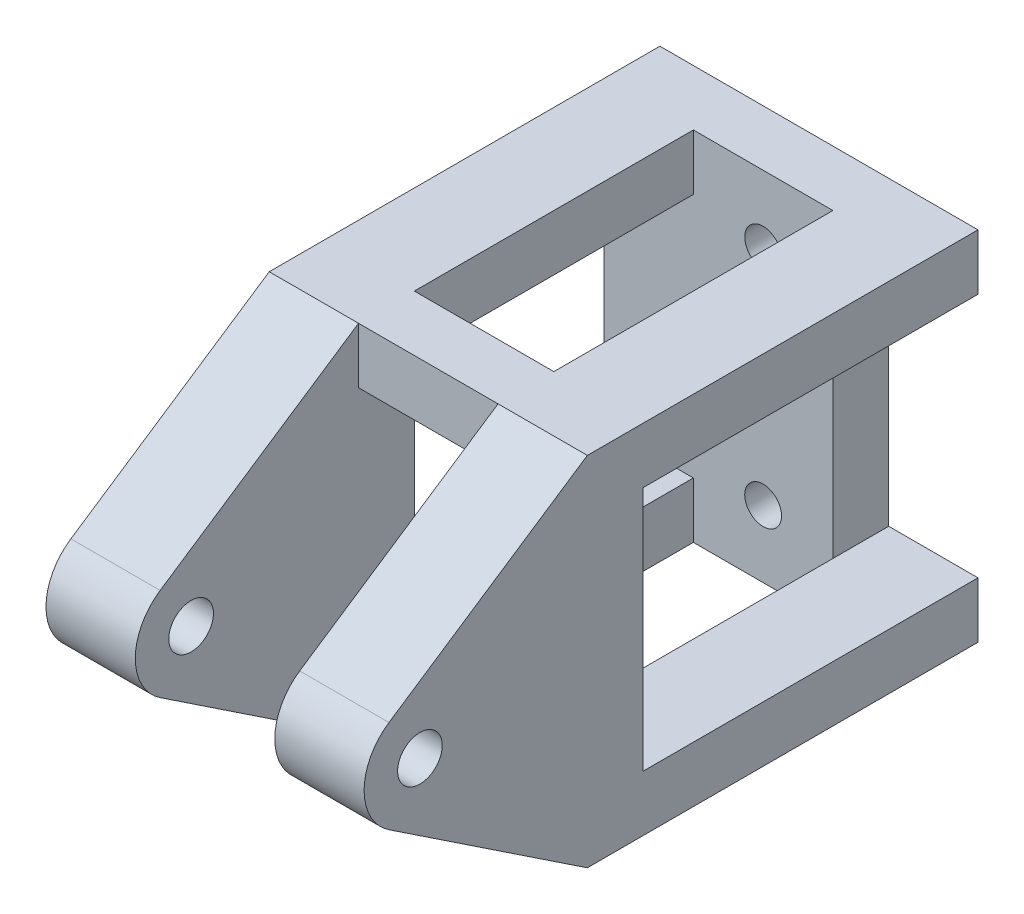
ISO-10303-21;
HEADER;
FILE_DESCRIPTION(('STEP AP214'),'2;1');
FILE_NAME('part.step','',(''),(''),'','','');
FILE_SCHEMA(('AUTOMOTIVE_DESIGN { 1 0 10303 214 1 1 1 1 }'));
ENDSEC;
DATA;
#1=APPLICATION_CONTEXT('core data for automotive mechanical design processes');
#2=APPLICATION_PROTOCOL_DEFINITION('international standard','automotive_design',2000,#1);
#3=PRODUCT_CONTEXT('',#1,'mechanical');
#4=PRODUCT('Part','Part','',(#3));
#5=PRODUCT_RELATED_PRODUCT_CATEGORY('part','',(#4));
#6=PRODUCT_DEFINITION_FORMATION('','',#4);
#7=PRODUCT_DEFINITION_CONTEXT('part definition',#1,'design');
#8=PRODUCT_DEFINITION('design','',#6,#7);
#9=PRODUCT_DEFINITION_SHAPE('','',#8);
#10=(LENGTH_UNIT() NAMED_UNIT(*) SI_UNIT(.MILLI.,.METRE.));
#11=(NAMED_UNIT(*) PLANE_ANGLE_UNIT() SI_UNIT($,.RADIAN.));
#12=(NAMED_UNIT(*) SI_UNIT($,.STERADIAN.) SOLID_ANGLE_UNIT());
#13=UNCERTAINTY_MEASURE_WITH_UNIT(LENGTH_MEASURE(1.E-05),#10,'distance_accuracy_value','');
#14=(GEOMETRIC_REPRESENTATION_CONTEXT(3) GLOBAL_UNCERTAINTY_ASSIGNED_CONTEXT((#13)) GLOBAL_UNIT_ASSIGNED_CONTEXT((#10,
#11,#12)) REPRESENTATION_CONTEXT('',''));
#15=CARTESIAN_POINT('',(0.,0.,0.));
#16=DIRECTION('',(0.,0.,1.));
#17=DIRECTION('',(1.,0.,0.));
#18=AXIS2_PLACEMENT_3D('',#15,#16,#17);
#19=CARTESIAN_POINT('',(6.25,0.,50.));
#20=DIRECTION('',(1.,0.,0.));
#21=DIRECTION('',(0.,0.,-1.));
#22=AXIS2_PLACEMENT_3D('',#19,#20,#21);
#23=PLANE('',#22);
#24=DIRECTION('',(0.,1.,0.));
#25=VECTOR('',#24,1.);
#26=CARTESIAN_POINT('',(6.25,-16.,30.));
#27=LINE('',#26,#25);
#28=CARTESIAN_POINT('',(6.25,-16.,30.));
#29=VERTEX_POINT('',#28);
#30=CARTESIAN_POINT('',(6.25000000000001,-11.,30.));
#31=VERTEX_POINT('',#30);
#32=EDGE_CURVE('E251',#29,#31,#27,.T.);
#33=ORIENTED_EDGE('',*,*,#32,.T.);
#34=DIRECTION('',(0.,0.,-1.));
#35=VECTOR('',#34,1.);
#36=CARTESIAN_POINT('',(6.25,-11.,50.));
#37=LINE('',#36,#35);
#38=CARTESIAN_POINT('',(6.25,-11.,5.));
#39=VERTEX_POINT('',#38);
#40=EDGE_CURVE('E319',#31,#39,#37,.T.);
#41=ORIENTED_EDGE('',*,*,#40,.T.);
#42=DIRECTION('',(0.,1.,0.));
#43=VECTOR('',#42,1.);
#44=CARTESIAN_POINT('',(6.25,-16.,5.));
#45=LINE('',#44,#43);
#46=CARTESIAN_POINT('',(6.25,-16.,5.));
#47=VERTEX_POINT('',#46);
#48=EDGE_CURVE('E379',#47,#39,#45,.T.);
#49=ORIENTED_EDGE('',*,*,#48,.F.);
#50=DIRECTION('',(0.,0.,-1.));
#51=VECTOR('',#50,1.);
#52=CARTESIAN_POINT('',(6.25,-16.,5.));
#53=LINE('',#52,#51);
#54=EDGE_CURVE('E394',#29,#47,#53,.T.);
#55=ORIENTED_EDGE('',*,*,#54,.F.);
#56=EDGE_LOOP('',(#33,#41,#49,#55));
#57=FACE_BOUND('',#56,.T.);
#58=ADVANCED_FACE('F33',(#57),#23,.F.);
#59=CARTESIAN_POINT('',(6.25,0.,50.));
#60=DIRECTION('',(1.,0.,0.));
#61=DIRECTION('',(0.,0.,-1.));
#62=AXIS2_PLACEMENT_3D('',#59,#60,#61);
#63=CIRCLE('',#62,2.);
#64=CARTESIAN_POINT('',(6.25,0.,48.));
#65=VERTEX_POINT('',#64);
#66=EDGE_CURVE('E373',#65,#65,#63,.T.);
#67=ORIENTED_EDGE('',*,*,#66,.T.);
#68=EDGE_LOOP('',(#67));
#69=FACE_BOUND('',#68,.T.);
#70=DIRECTION('',(0.,0.,1.));
#71=VECTOR('',#70,1.);
#72=CARTESIAN_POINT('',(6.25,-11.,35.));
#73=LINE('',#72,#71);
#74=CARTESIAN_POINT('',(6.25,-11.,35.));
#75=VERTEX_POINT('',#74);
#76=EDGE_CURVE('E228',#31,#75,#73,.T.);
#77=ORIENTED_EDGE('',*,*,#76,.T.);
#78=DIRECTION('',(0.,-1.,0.));
#79=VECTOR('',#78,1.);
#80=CARTESIAN_POINT('',(6.25,-16.,35.));
#81=LINE('',#80,#79);
#82=CARTESIAN_POINT('',(6.25,-16.,35.));
#83=VERTEX_POINT('',#82);
#84=EDGE_CURVE('E242',#75,#83,#81,.T.);
#85=ORIENTED_EDGE('',*,*,#84,.T.);
#86=DIRECTION('',(0.,-0.554400216351355,-0.832250202829396));
#87=VECTOR('',#86,1.);
#88=CARTESIAN_POINT('',(6.25,-16.,35.));
#89=LINE('',#88,#87);
#90=CARTESIAN_POINT('',(6.25,-4.16125101414698,52.7720010817568));
#91=VERTEX_POINT('',#90);
#92=EDGE_CURVE('E391',#91,#83,#89,.T.);
#93=ORIENTED_EDGE('',*,*,#92,.F.);
#94=CARTESIAN_POINT('',(6.25,0.,50.));
#95=DIRECTION('',(1.,0.,0.));
#96=DIRECTION('',(0.,0.,-1.));
#97=AXIS2_PLACEMENT_3D('',#94,#95,#96);
#98=CIRCLE('',#97,5.);
#99=CARTESIAN_POINT('',(6.25,4.16125101414698,52.7720010817568));
#100=VERTEX_POINT('',#99);
#101=EDGE_CURVE('E388',#100,#91,#98,.T.);
#102=ORIENTED_EDGE('',*,*,#101,.F.);
#103=DIRECTION('',(0.,-0.554400216351356,0.832250202829396));
#104=VECTOR('',#103,1.);
#105=CARTESIAN_POINT('',(6.25,16.,35.));
#106=LINE('',#105,#104);
#107=CARTESIAN_POINT('',(6.25,16.,35.));
#108=VERTEX_POINT('',#107);
#109=EDGE_CURVE('E385',#108,#100,#106,.T.);
#110=ORIENTED_EDGE('',*,*,#109,.F.);
#111=DIRECTION('',(0.,-1.,0.));
#112=VECTOR('',#111,1.);
#113=CARTESIAN_POINT('',(6.25,16.,35.));
#114=LINE('',#113,#112);
#115=CARTESIAN_POINT('',(6.25,11.,35.));
#116=VERTEX_POINT('',#115);
#117=EDGE_CURVE('E271',#108,#116,#114,.T.);
#118=ORIENTED_EDGE('',*,*,#117,.T.);
#119=DIRECTION('',(0.,0.,-1.));
#120=VECTOR('',#119,1.);
#121=CARTESIAN_POINT('',(6.25,11.,35.));
#122=LINE('',#121,#120);
#123=CARTESIAN_POINT('',(6.25,11.,30.));
#124=VERTEX_POINT('',#123);
#125=EDGE_CURVE('E280',#116,#124,#122,.T.);
#126=ORIENTED_EDGE('',*,*,#125,.T.);
#127=DIRECTION('',(0.,-1.,0.));
#128=VECTOR('',#127,1.);
#129=CARTESIAN_POINT('',(6.25,0.,30.));
#130=LINE('',#129,#128);
#131=EDGE_CURVE('E316',#124,#31,#130,.T.);
#132=ORIENTED_EDGE('',*,*,#131,.T.);
#133=EDGE_LOOP('',(#77,#85,#93,#102,#110,#118,#126,#132));
#134=FACE_BOUND('',#133,.T.);
#135=ADVANCED_FACE('F537',(#69,#134),#23,.F.);
#136=CARTESIAN_POINT('',(-6.25,0.,50.));
#137=DIRECTION('',(-1.,0.,0.));
#138=DIRECTION('',(0.,0.,-1.));
#139=AXIS2_PLACEMENT_3D('',#136,#137,#138);
#140=PLANE('',#139);
#141=DIRECTION('',(0.,1.,0.));
#142=VECTOR('',#141,1.);
#143=CARTESIAN_POINT('',(-6.25,-16.,30.));
#144=LINE('',#143,#142);
#145=CARTESIAN_POINT('',(-6.25,-16.,30.));
#146=VERTEX_POINT('',#145);
#147=CARTESIAN_POINT('',(-6.25,-11.,30.));
#148=VERTEX_POINT('',#147);
#149=EDGE_CURVE('E234',#146,#148,#144,.T.);
#150=ORIENTED_EDGE('',*,*,#149,.F.);
#151=DIRECTION('',(0.,0.,-1.));
#152=VECTOR('',#151,1.);
#153=CARTESIAN_POINT('',(-6.25,-16.,5.));
#154=LINE('',#153,#152);
#155=CARTESIAN_POINT('',(-6.25,-16.,5.));
#156=VERTEX_POINT('',#155);
#157=EDGE_CURVE('E343',#146,#156,#154,.T.);
#158=ORIENTED_EDGE('',*,*,#157,.T.);
#159=DIRECTION('',(0.,1.,0.));
#160=VECTOR('',#159,1.);
#161=CARTESIAN_POINT('',(-6.25,-16.,5.));
#162=LINE('',#161,#160);
#163=CARTESIAN_POINT('',(-6.25,-11.,5.));
#164=VERTEX_POINT('',#163);
#165=EDGE_CURVE('E340',#156,#164,#162,.T.);
#166=ORIENTED_EDGE('',*,*,#165,.T.);
#167=DIRECTION('',(0.,0.,1.));
#168=VECTOR('',#167,1.);
#169=CARTESIAN_POINT('',(-6.25,-11.,50.));
#170=LINE('',#169,#168);
#171=EDGE_CURVE('E11',#164,#148,#170,.T.);
#172=ORIENTED_EDGE('',*,*,#171,.T.);
#173=EDGE_LOOP('',(#150,#158,#166,#172));
#174=FACE_BOUND('',#173,.T.);
#175=ADVANCED_FACE('F503',(#174),#140,.F.);
#176=CARTESIAN_POINT('',(-6.25,0.,50.));
#177=DIRECTION('',(1.,0.,0.));
#178=DIRECTION('',(0.,0.,-1.));
#179=AXIS2_PLACEMENT_3D('',#176,#177,#178);
#180=CIRCLE('',#179,2.);
#181=CARTESIAN_POINT('',(-6.25,0.,48.));
#182=VERTEX_POINT('',#181);
#183=EDGE_CURVE('E334',#182,#182,#180,.T.);
#184=ORIENTED_EDGE('',*,*,#183,.F.);
#185=EDGE_LOOP('',(#184));
#186=FACE_BOUND('',#185,.T.);
#187=DIRECTION('',(0.,0.,1.));
#188=VECTOR('',#187,1.);
#189=CARTESIAN_POINT('',(-6.25,-11.,35.));
#190=LINE('',#189,#188);
#191=CARTESIAN_POINT('',(-6.25,-11.,35.));
#192=VERTEX_POINT('',#191);
#193=EDGE_CURVE('E231',#148,#192,#190,.T.);
#194=ORIENTED_EDGE('',*,*,#193,.F.);
#195=DIRECTION('',(0.,1.,0.));
#196=VECTOR('',#195,1.);
#197=CARTESIAN_POINT('',(-6.25,0.,30.));
#198=LINE('',#197,#196);
#199=CARTESIAN_POINT('',(-6.25,11.,30.));
#200=VERTEX_POINT('',#199);
#201=EDGE_CURVE('E41',#148,#200,#198,.T.);
#202=ORIENTED_EDGE('',*,*,#201,.T.);
#203=DIRECTION('',(0.,0.,-1.));
#204=VECTOR('',#203,1.);
#205=CARTESIAN_POINT('',(-6.25,11.,35.));
#206=LINE('',#205,#204);
#207=CARTESIAN_POINT('',(-6.25,11.,35.));
#208=VERTEX_POINT('',#207);
#209=EDGE_CURVE('E259',#208,#200,#206,.T.);
#210=ORIENTED_EDGE('',*,*,#209,.F.);
#211=DIRECTION('',(0.,-1.,0.));
#212=VECTOR('',#211,1.);
#213=CARTESIAN_POINT('',(-6.25,16.,35.));
#214=LINE('',#213,#212);
#215=CARTESIAN_POINT('',(-6.25,16.,35.));
#216=VERTEX_POINT('',#215);
#217=EDGE_CURVE('E261',#216,#208,#214,.T.);
#218=ORIENTED_EDGE('',*,*,#217,.F.);
#219=DIRECTION('',(0.,-0.554400216351356,0.832250202829396));
#220=VECTOR('',#219,1.);
#221=CARTESIAN_POINT('',(-6.25,16.,35.));
#222=LINE('',#221,#220);
#223=CARTESIAN_POINT('',(-6.25,4.16125101414698,52.7720010817568));
#224=VERTEX_POINT('',#223);
#225=EDGE_CURVE('E350',#216,#224,#222,.T.);
#226=ORIENTED_EDGE('',*,*,#225,.T.);
#227=CARTESIAN_POINT('',(-6.25,0.,50.));
#228=DIRECTION('',(1.,0.,0.));
#229=DIRECTION('',(0.,0.,-1.));
#230=AXIS2_PLACEMENT_3D('',#227,#228,#229);
#231=CIRCLE('',#230,5.);
#232=CARTESIAN_POINT('',(-6.25,-4.16125101414698,52.7720010817568));
#233=VERTEX_POINT('',#232);
#234=EDGE_CURVE('E348',#224,#233,#231,.T.);
#235=ORIENTED_EDGE('',*,*,#234,.T.);
#236=DIRECTION('',(0.,-0.554400216351355,-0.832250202829396));
#237=VECTOR('',#236,1.);
#238=CARTESIAN_POINT('',(-6.25,-16.,35.));
#239=LINE('',#238,#237);
#240=CARTESIAN_POINT('',(-6.25,-16.,35.));
#241=VERTEX_POINT('',#240);
#242=EDGE_CURVE('E346',#233,#241,#239,.T.);
#243=ORIENTED_EDGE('',*,*,#242,.T.);
#244=DIRECTION('',(0.,-1.,0.));
#245=VECTOR('',#244,1.);
#246=CARTESIAN_POINT('',(-6.25,-16.,35.));
#247=LINE('',#246,#245);
#248=EDGE_CURVE('E56',#192,#241,#247,.T.);
#249=ORIENTED_EDGE('',*,*,#248,.F.);
#250=EDGE_LOOP('',(#194,#202,#210,#218,#226,#235,#243,#249));
#251=FACE_BOUND('',#250,.T.);
#252=ADVANCED_FACE('F444',(#186,#251),#140,.F.);
#253=DIRECTION('',(0.,1.,0.));
#254=VECTOR('',#253,1.);
#255=CARTESIAN_POINT('',(6.25,16.,30.));
#256=LINE('',#255,#254);
#257=CARTESIAN_POINT('',(6.25,16.,30.));
#258=VERTEX_POINT('',#257);
#259=EDGE_CURVE('E230',#124,#258,#256,.T.);
#260=ORIENTED_EDGE('',*,*,#259,.T.);
#261=DIRECTION('',(0.,0.,1.));
#262=VECTOR('',#261,1.);
#263=CARTESIAN_POINT('',(6.25,16.,5.));
#264=LINE('',#263,#262);
#265=CARTESIAN_POINT('',(6.25,16.,5.));
#266=VERTEX_POINT('',#265);
#267=EDGE_CURVE('E381',#266,#258,#264,.T.);
#268=ORIENTED_EDGE('',*,*,#267,.F.);
#269=CARTESIAN_POINT('',(6.25,11.,5.));
#270=VERTEX_POINT('',#269);
#271=EDGE_CURVE('E382',#270,#266,#45,.T.);
#272=ORIENTED_EDGE('',*,*,#271,.F.);
#273=DIRECTION('',(0.,0.,1.));
#274=VECTOR('',#273,1.);
#275=CARTESIAN_POINT('',(6.25,11.,50.));
#276=LINE('',#275,#274);
#277=EDGE_CURVE('E305',#270,#124,#276,.T.);
#278=ORIENTED_EDGE('',*,*,#277,.T.);
#279=EDGE_LOOP('',(#260,#268,#272,#278));
#280=FACE_BOUND('',#279,.T.);
#281=ADVANCED_FACE('F540',(#280),#23,.F.);
#282=DIRECTION('',(0.,1.,0.));
#283=VECTOR('',#282,1.);
#284=CARTESIAN_POINT('',(-6.25,16.,30.));
#285=LINE('',#284,#283);
#286=CARTESIAN_POINT('',(-6.25,16.,30.));
#287=VERTEX_POINT('',#286);
#288=EDGE_CURVE('E256',#200,#287,#285,.T.);
#289=ORIENTED_EDGE('',*,*,#288,.F.);
#290=DIRECTION('',(0.,0.,-1.));
#291=VECTOR('',#290,1.);
#292=CARTESIAN_POINT('',(-6.25,11.,50.));
#293=LINE('',#292,#291);
#294=CARTESIAN_POINT('',(-6.25,11.,5.));
#295=VERTEX_POINT('',#294);
#296=EDGE_CURVE('E441',#200,#295,#293,.T.);
#297=ORIENTED_EDGE('',*,*,#296,.T.);
#298=CARTESIAN_POINT('',(-6.25000000000001,16.,5.));
#299=VERTEX_POINT('',#298);
#300=EDGE_CURVE('E344',#295,#299,#162,.T.);
#301=ORIENTED_EDGE('',*,*,#300,.T.);
#302=DIRECTION('',(0.,0.,1.));
#303=VECTOR('',#302,1.);
#304=CARTESIAN_POINT('',(-6.25,16.,5.));
#305=LINE('',#304,#303);
#306=EDGE_CURVE('E352',#299,#287,#305,.T.);
#307=ORIENTED_EDGE('',*,*,#306,.T.);
#308=EDGE_LOOP('',(#289,#297,#301,#307));
#309=FACE_BOUND('',#308,.T.);
#310=ADVANCED_FACE('F455',(#309),#140,.F.);
#311=CARTESIAN_POINT('',(0.,0.,5.));
#312=DIRECTION('',(0.,0.,1.));
#313=DIRECTION('',(1.,0.,0.));
#314=AXIS2_PLACEMENT_3D('',#311,#312,#313);
#315=PLANE('',#314);
#316=DIRECTION('',(0.,-1.,0.));
#317=VECTOR('',#316,1.);
#318=CARTESIAN_POINT('',(6.25,0.,5.));
#319=LINE('',#318,#317);
#320=EDGE_CURVE('E208',#270,#39,#319,.T.);
#321=ORIENTED_EDGE('',*,*,#320,.F.);
#322=ORIENTED_EDGE('',*,*,#271,.T.);
#323=DIRECTION('',(-1.,0.,0.));
#324=VECTOR('',#323,1.);
#325=CARTESIAN_POINT('',(-14.25,16.,5.));
#326=LINE('',#325,#324);
#327=EDGE_CURVE('E415',#266,#299,#326,.T.);
#328=ORIENTED_EDGE('',*,*,#327,.T.);
#329=ORIENTED_EDGE('',*,*,#300,.F.);
#330=DIRECTION('',(1.,0.,0.));
#331=VECTOR('',#330,1.);
#332=CARTESIAN_POINT('',(-14.25,11.,5.));
#333=LINE('',#332,#331);
#334=CARTESIAN_POINT('',(-14.25,11.,5.));
#335=VERTEX_POINT('',#334);
#336=EDGE_CURVE('E296',#335,#295,#333,.T.);
#337=ORIENTED_EDGE('',*,*,#336,.F.);
#338=DIRECTION('',(0.,1.,0.));
#339=VECTOR('',#338,1.);
#340=CARTESIAN_POINT('',(-14.25,11.,5.));
#341=LINE('',#340,#339);
#342=CARTESIAN_POINT('',(-14.25,-11.,5.));
#343=VERTEX_POINT('',#342);
#344=EDGE_CURVE('E284',#343,#335,#341,.T.);
#345=ORIENTED_EDGE('',*,*,#344,.F.);
#346=DIRECTION('',(1.,0.,0.));
#347=VECTOR('',#346,1.);
#348=CARTESIAN_POINT('',(-14.25,-11.,5.));
#349=LINE('',#348,#347);
#350=EDGE_CURVE('E302',#343,#164,#349,.T.);
#351=ORIENTED_EDGE('',*,*,#350,.T.);
#352=ORIENTED_EDGE('',*,*,#165,.F.);
#353=DIRECTION('',(1.,0.,0.));
#354=VECTOR('',#353,1.);
#355=CARTESIAN_POINT('',(-14.25,-16.,5.));
#356=LINE('',#355,#354);
#357=EDGE_CURVE('E418',#156,#47,#356,.T.);
#358=ORIENTED_EDGE('',*,*,#357,.T.);
#359=ORIENTED_EDGE('',*,*,#48,.T.);
#360=EDGE_LOOP('',(#321,#322,#328,#329,#337,#345,#351,#352,#358,#359));
#361=FACE_BOUND('',#360,.T.);
#362=CARTESIAN_POINT('',(0.,-9.99999999999977,5.));
#363=DIRECTION('',(0.,0.,1.));
#364=DIRECTION('',(-1.,0.,0.));
#365=AXIS2_PLACEMENT_3D('',#362,#363,#364);
#366=CIRCLE('',#365,1.65);
#367=CARTESIAN_POINT('',(-1.65000000000007,-9.99999999999977,5.));
#368=VERTEX_POINT('',#367);
#369=EDGE_CURVE('E321',#368,#368,#366,.T.);
#370=ORIENTED_EDGE('',*,*,#369,.F.);
#371=EDGE_LOOP('',(#370));
#372=FACE_BOUND('',#371,.T.);
#373=CARTESIAN_POINT('',(0.,9.99999999999977,5.));
#374=DIRECTION('',(0.,0.,1.));
#375=DIRECTION('',(1.,0.,0.));
#376=AXIS2_PLACEMENT_3D('',#373,#374,#375);
#377=CIRCLE('',#376,1.65);
#378=CARTESIAN_POINT('',(1.64999999999993,9.99999999999977,5.));
#379=VERTEX_POINT('',#378);
#380=EDGE_CURVE('E326',#379,#379,#377,.T.);
#381=ORIENTED_EDGE('',*,*,#380,.F.);
#382=EDGE_LOOP('',(#381));
#383=FACE_BOUND('',#382,.T.);
#384=ADVANCED_FACE('F511',(#361,#372,#383),#315,.T.);
#385=CARTESIAN_POINT('',(14.25,16.,5.));
#386=DIRECTION('',(-1.,0.,0.));
#387=DIRECTION('',(0.,-1.,0.));
#388=AXIS2_PLACEMENT_3D('',#385,#386,#387);
#389=PLANE('',#388);
#390=DIRECTION('',(0.,0.,1.));
#391=VECTOR('',#390,1.);
#392=CARTESIAN_POINT('',(14.25,11.,30.));
#393=LINE('',#392,#391);
#394=CARTESIAN_POINT('',(14.25,11.,0.));
#395=VERTEX_POINT('',#394);
#396=CARTESIAN_POINT('',(14.25,11.,30.));
#397=VERTEX_POINT('',#396);
#398=EDGE_CURVE('E264',#395,#397,#393,.T.);
#399=ORIENTED_EDGE('',*,*,#398,.F.);
#400=DIRECTION('',(0.,1.,0.));
#401=VECTOR('',#400,1.);
#402=CARTESIAN_POINT('',(14.25,16.,0.));
#403=LINE('',#402,#401);
#404=CARTESIAN_POINT('',(14.25,16.,0.));
#405=VERTEX_POINT('',#404);
#406=EDGE_CURVE('E408',#395,#405,#403,.T.);
#407=ORIENTED_EDGE('',*,*,#406,.T.);
#408=DIRECTION('',(0.,0.,-1.));
#409=VECTOR('',#408,1.);
#410=CARTESIAN_POINT('',(14.25,16.,5.));
#411=LINE('',#410,#409);
#412=CARTESIAN_POINT('',(14.25,16.,35.));
#413=VERTEX_POINT('',#412);
#414=EDGE_CURVE('E438',#413,#405,#411,.T.);
#415=ORIENTED_EDGE('',*,*,#414,.F.);
#416=DIRECTION('',(0.,-0.554400216351356,0.832250202829396));
#417=VECTOR('',#416,1.);
#418=CARTESIAN_POINT('',(14.25,16.,35.));
#419=LINE('',#418,#417);
#420=CARTESIAN_POINT('',(14.25,4.16125101414698,52.7720010817568));
#421=VERTEX_POINT('',#420);
#422=EDGE_CURVE('E376',#413,#421,#419,.T.);
#423=ORIENTED_EDGE('',*,*,#422,.T.);
#424=CARTESIAN_POINT('',(14.25,0.,50.));
#425=DIRECTION('',(1.,0.,0.));
#426=DIRECTION('',(0.,0.,-1.));
#427=AXIS2_PLACEMENT_3D('',#424,#425,#426);
#428=CIRCLE('',#427,5.);
#429=CARTESIAN_POINT('',(14.25,-4.16125101414698,52.7720010817568));
#430=VERTEX_POINT('',#429);
#431=EDGE_CURVE('E399',#421,#430,#428,.T.);
#432=ORIENTED_EDGE('',*,*,#431,.T.);
#433=DIRECTION('',(0.,-0.554400216351355,-0.832250202829396));
#434=VECTOR('',#433,1.);
#435=CARTESIAN_POINT('',(14.25,-16.,35.));
#436=LINE('',#435,#434);
#437=CARTESIAN_POINT('',(14.25,-16.,35.));
#438=VERTEX_POINT('',#437);
#439=EDGE_CURVE('E402',#430,#438,#436,.T.);
#440=ORIENTED_EDGE('',*,*,#439,.T.);
#441=DIRECTION('',(0.,0.,-1.));
#442=VECTOR('',#441,1.);
#443=CARTESIAN_POINT('',(14.25,-16.,5.));
#444=LINE('',#443,#442);
#445=CARTESIAN_POINT('',(14.25,-16.,0.));
#446=VERTEX_POINT('',#445);
#447=EDGE_CURVE('E422',#438,#446,#444,.T.);
#448=ORIENTED_EDGE('',*,*,#447,.T.);
#449=CARTESIAN_POINT('',(14.25,-11.,0.));
#450=VERTEX_POINT('',#449);
#451=EDGE_CURVE('E423',#446,#450,#403,.T.);
#452=ORIENTED_EDGE('',*,*,#451,.T.);
#453=DIRECTION('',(0.,0.,-1.));
#454=VECTOR('',#453,1.);
#455=CARTESIAN_POINT('',(14.25,-11.,30.));
#456=LINE('',#455,#454);
#457=CARTESIAN_POINT('',(14.25,-11.,30.));
#458=VERTEX_POINT('',#457);
#459=EDGE_CURVE('E48',#458,#450,#456,.T.);
#460=ORIENTED_EDGE('',*,*,#459,.F.);
#461=DIRECTION('',(0.,-1.,0.));
#462=VECTOR('',#461,1.);
#463=CARTESIAN_POINT('',(14.25,11.,30.));
#464=LINE('',#463,#462);
#465=EDGE_CURVE('E298',#397,#458,#464,.T.);
#466=ORIENTED_EDGE('',*,*,#465,.F.);
#467=EDGE_LOOP('',(#399,#407,#415,#423,#432,#440,#448,#452,#460,#466));
#468=FACE_BOUND('',#467,.T.);
#469=CARTESIAN_POINT('',(14.25,0.,50.));
#470=DIRECTION('',(1.,0.,0.));
#471=DIRECTION('',(0.,0.,-1.));
#472=AXIS2_PLACEMENT_3D('',#469,#470,#471);
#473=CIRCLE('',#472,2.);
#474=CARTESIAN_POINT('',(14.25,0.,48.));
#475=VERTEX_POINT('',#474);
#476=EDGE_CURVE('E364',#475,#475,#473,.T.);
#477=ORIENTED_EDGE('',*,*,#476,.F.);
#478=EDGE_LOOP('',(#477));
#479=FACE_BOUND('',#478,.T.);
#480=ADVANCED_FACE('F35',(#468,#479),#389,.F.);
#481=CARTESIAN_POINT('',(-14.25,16.,5.));
#482=DIRECTION('',(0.,-1.,0.));
#483=DIRECTION('',(0.,0.,-1.));
#484=AXIS2_PLACEMENT_3D('',#481,#482,#483);
#485=PLANE('',#484);
#486=DIRECTION('',(-1.,0.,0.));
#487=VECTOR('',#486,1.);
#488=CARTESIAN_POINT('',(14.252,16.,35.));
#489=LINE('',#488,#487);
#490=EDGE_CURVE('E260',#108,#216,#489,.T.);
#491=ORIENTED_EDGE('',*,*,#490,.F.);
#492=DIRECTION('',(1.,0.,0.));
#493=VECTOR('',#492,1.);
#494=CARTESIAN_POINT('',(6.25,16.,35.));
#495=LINE('',#494,#493);
#496=EDGE_CURVE('E396',#108,#413,#495,.T.);
#497=ORIENTED_EDGE('',*,*,#496,.T.);
#498=ORIENTED_EDGE('',*,*,#414,.T.);
#499=DIRECTION('',(-1.,0.,0.));
#500=VECTOR('',#499,1.);
#501=CARTESIAN_POINT('',(-14.25,16.,0.));
#502=LINE('',#501,#500);
#503=CARTESIAN_POINT('',(-14.25,16.,0.));
#504=VERTEX_POINT('',#503);
#505=EDGE_CURVE('E425',#405,#504,#502,.T.);
#506=ORIENTED_EDGE('',*,*,#505,.T.);
#507=DIRECTION('',(0.,0.,-1.));
#508=VECTOR('',#507,1.);
#509=CARTESIAN_POINT('',(-14.25,16.,5.));
#510=LINE('',#509,#508);
#511=CARTESIAN_POINT('',(-14.25,16.,35.));
#512=VERTEX_POINT('',#511);
#513=EDGE_CURVE('E435',#512,#504,#510,.T.);
#514=ORIENTED_EDGE('',*,*,#513,.F.);
#515=DIRECTION('',(-1.,0.,0.));
#516=VECTOR('',#515,1.);
#517=CARTESIAN_POINT('',(-6.25,16.,35.));
#518=LINE('',#517,#516);
#519=EDGE_CURVE('E361',#216,#512,#518,.T.);
#520=ORIENTED_EDGE('',*,*,#519,.F.);
#521=EDGE_LOOP('',(#491,#497,#498,#506,#514,#520));
#522=FACE_BOUND('',#521,.T.);
#523=ORIENTED_EDGE('',*,*,#267,.T.);
#524=DIRECTION('',(-1.,0.,0.));
#525=VECTOR('',#524,1.);
#526=CARTESIAN_POINT('',(14.252,16.,30.));
#527=LINE('',#526,#525);
#528=EDGE_CURVE('E274',#258,#287,#527,.T.);
#529=ORIENTED_EDGE('',*,*,#528,.T.);
#530=ORIENTED_EDGE('',*,*,#306,.F.);
#531=ORIENTED_EDGE('',*,*,#327,.F.);
#532=EDGE_LOOP('',(#523,#529,#530,#531));
#533=FACE_BOUND('',#532,.T.);
#534=ADVANCED_FACE('F474',(#522,#533),#485,.F.);
#535=CARTESIAN_POINT('',(-14.25,16.,5.));
#536=DIRECTION('',(1.,0.,0.));
#537=DIRECTION('',(0.,1.,0.));
#538=AXIS2_PLACEMENT_3D('',#535,#536,#537);
#539=PLANE('',#538);
#540=DIRECTION('',(0.,0.,-1.));
#541=VECTOR('',#540,1.);
#542=CARTESIAN_POINT('',(-14.25,-11.,30.));
#543=LINE('',#542,#541);
#544=CARTESIAN_POINT('',(-14.25,-11.,30.));
#545=VERTEX_POINT('',#544);
#546=EDGE_CURVE('E293',#545,#343,#543,.T.);
#547=ORIENTED_EDGE('',*,*,#546,.T.);
#548=ORIENTED_EDGE('',*,*,#344,.T.);
#549=DIRECTION('',(0.,0.,1.));
#550=VECTOR('',#549,1.);
#551=CARTESIAN_POINT('',(-14.25,11.,30.));
#552=LINE('',#551,#550);
#553=CARTESIAN_POINT('',(-14.25,11.,30.));
#554=VERTEX_POINT('',#553);
#555=EDGE_CURVE('E287',#335,#554,#552,.T.);
#556=ORIENTED_EDGE('',*,*,#555,.T.);
#557=DIRECTION('',(0.,-1.,0.));
#558=VECTOR('',#557,1.);
#559=CARTESIAN_POINT('',(-14.25,11.,30.));
#560=LINE('',#559,#558);
#561=EDGE_CURVE('E290',#554,#545,#560,.T.);
#562=ORIENTED_EDGE('',*,*,#561,.T.);
#563=EDGE_LOOP('',(#547,#548,#556,#562));
#564=FACE_BOUND('',#563,.T.);
#565=DIRECTION('',(0.,-1.,0.));
#566=VECTOR('',#565,1.);
#567=CARTESIAN_POINT('',(-14.25,16.,0.));
#568=LINE('',#567,#566);
#569=CARTESIAN_POINT('',(-14.25,-16.,0.));
#570=VERTEX_POINT('',#569);
#571=EDGE_CURVE('E427',#504,#570,#568,.T.);
#572=ORIENTED_EDGE('',*,*,#571,.T.);
#573=DIRECTION('',(0.,0.,-1.));
#574=VECTOR('',#573,1.);
#575=CARTESIAN_POINT('',(-14.25,-16.,5.));
#576=LINE('',#575,#574);
#577=CARTESIAN_POINT('',(-14.25,-16.,35.));
#578=VERTEX_POINT('',#577);
#579=EDGE_CURVE('E432',#578,#570,#576,.T.);
#580=ORIENTED_EDGE('',*,*,#579,.F.);
#581=DIRECTION('',(0.,-0.554400216351355,-0.832250202829396));
#582=VECTOR('',#581,1.);
#583=CARTESIAN_POINT('',(-14.25,-16.,35.));
#584=LINE('',#583,#582);
#585=CARTESIAN_POINT('',(-14.25,-4.16125101414698,52.7720010817568));
#586=VERTEX_POINT('',#585);
#587=EDGE_CURVE('E337',#586,#578,#584,.T.);
#588=ORIENTED_EDGE('',*,*,#587,.F.);
#589=CARTESIAN_POINT('',(-14.25,0.,50.));
#590=DIRECTION('',(1.,0.,0.));
#591=DIRECTION('',(0.,0.,-1.));
#592=AXIS2_PLACEMENT_3D('',#589,#590,#591);
#593=CIRCLE('',#592,5.);
#594=CARTESIAN_POINT('',(-14.25,4.16125101414698,52.7720010817568));
#595=VERTEX_POINT('',#594);
#596=EDGE_CURVE('E357',#595,#586,#593,.T.);
#597=ORIENTED_EDGE('',*,*,#596,.F.);
#598=DIRECTION('',(0.,-0.554400216351356,0.832250202829396));
#599=VECTOR('',#598,1.);
#600=CARTESIAN_POINT('',(-14.25,16.,35.));
#601=LINE('',#600,#599);
#602=EDGE_CURVE('E359',#512,#595,#601,.T.);
#603=ORIENTED_EDGE('',*,*,#602,.F.);
#604=ORIENTED_EDGE('',*,*,#513,.T.);
#605=EDGE_LOOP('',(#572,#580,#588,#597,#603,#604));
#606=FACE_BOUND('',#605,.T.);
#607=CARTESIAN_POINT('',(-14.25,0.,50.));
#608=DIRECTION('',(1.,0.,0.));
#609=DIRECTION('',(0.,0.,-1.));
#610=AXIS2_PLACEMENT_3D('',#607,#608,#609);
#611=CIRCLE('',#610,2.);
#612=CARTESIAN_POINT('',(-14.25,0.,48.));
#613=VERTEX_POINT('',#612);
#614=EDGE_CURVE('E325',#613,#613,#611,.T.);
#615=ORIENTED_EDGE('',*,*,#614,.T.);
#616=EDGE_LOOP('',(#615));
#617=FACE_BOUND('',#616,.T.);
#618=ADVANCED_FACE('F514',(#564,#606,#617),#539,.F.);
#619=CARTESIAN_POINT('',(-14.25,-16.,5.));
#620=DIRECTION('',(0.,1.,0.));
#621=DIRECTION('',(0.,0.,1.));
#622=AXIS2_PLACEMENT_3D('',#619,#620,#621);
#623=PLANE('',#622);
#624=DIRECTION('',(-1.,0.,0.));
#625=VECTOR('',#624,1.);
#626=CARTESIAN_POINT('',(14.252,-16.,30.));
#627=LINE('',#626,#625);
#628=EDGE_CURVE('E241',#29,#146,#627,.T.);
#629=ORIENTED_EDGE('',*,*,#628,.F.);
#630=ORIENTED_EDGE('',*,*,#54,.T.);
#631=ORIENTED_EDGE('',*,*,#357,.F.);
#632=ORIENTED_EDGE('',*,*,#157,.F.);
#633=EDGE_LOOP('',(#629,#630,#631,#632));
#634=FACE_BOUND('',#633,.T.);
#635=DIRECTION('',(1.,0.,0.));
#636=VECTOR('',#635,1.);
#637=CARTESIAN_POINT('',(-14.25,-16.,0.));
#638=LINE('',#637,#636);
#639=EDGE_CURVE('E419',#570,#446,#638,.T.);
#640=ORIENTED_EDGE('',*,*,#639,.T.);
#641=ORIENTED_EDGE('',*,*,#447,.F.);
#642=DIRECTION('',(1.,0.,0.));
#643=VECTOR('',#642,1.);
#644=CARTESIAN_POINT('',(6.25,-16.,35.));
#645=LINE('',#644,#643);
#646=EDGE_CURVE('E405',#83,#438,#645,.T.);
#647=ORIENTED_EDGE('',*,*,#646,.F.);
#648=DIRECTION('',(-1.,0.,0.));
#649=VECTOR('',#648,1.);
#650=CARTESIAN_POINT('',(14.252,-16.,35.));
#651=LINE('',#650,#649);
#652=EDGE_CURVE('E238',#83,#241,#651,.T.);
#653=ORIENTED_EDGE('',*,*,#652,.T.);
#654=DIRECTION('',(-1.,0.,0.));
#655=VECTOR('',#654,1.);
#656=CARTESIAN_POINT('',(-6.25,-16.,35.));
#657=LINE('',#656,#655);
#658=EDGE_CURVE('E354',#241,#578,#657,.T.);
#659=ORIENTED_EDGE('',*,*,#658,.T.);
#660=ORIENTED_EDGE('',*,*,#579,.T.);
#661=EDGE_LOOP('',(#640,#641,#647,#653,#659,#660));
#662=FACE_BOUND('',#661,.T.);
#663=ADVANCED_FACE('F491',(#634,#662),#623,.F.);
#664=CARTESIAN_POINT('',(0.,0.,0.));
#665=DIRECTION('',(0.,0.,1.));
#666=DIRECTION('',(1.,0.,0.));
#667=AXIS2_PLACEMENT_3D('',#664,#665,#666);
#668=PLANE('',#667);
#669=CARTESIAN_POINT('',(0.,9.99999999999977,0.));
#670=DIRECTION('',(0.,0.,1.));
#671=DIRECTION('',(1.,0.,0.));
#672=AXIS2_PLACEMENT_3D('',#669,#670,#671);
#673=CIRCLE('',#672,1.65);
#674=CARTESIAN_POINT('',(1.64999999999993,9.99999999999977,0.));
#675=VERTEX_POINT('',#674);
#676=EDGE_CURVE('E322',#675,#675,#673,.T.);
#677=ORIENTED_EDGE('',*,*,#676,.T.);
#678=EDGE_LOOP('',(#677));
#679=FACE_BOUND('',#678,.T.);
#680=CARTESIAN_POINT('',(0.,-9.99999999999977,0.));
#681=DIRECTION('',(0.,0.,1.));
#682=DIRECTION('',(-1.,0.,0.));
#683=AXIS2_PLACEMENT_3D('',#680,#681,#682);
#684=CIRCLE('',#683,1.65);
#685=CARTESIAN_POINT('',(-1.65000000000007,-9.99999999999977,0.));
#686=VERTEX_POINT('',#685);
#687=EDGE_CURVE('E329',#686,#686,#684,.T.);
#688=ORIENTED_EDGE('',*,*,#687,.T.);
#689=EDGE_LOOP('',(#688));
#690=FACE_BOUND('',#689,.T.);
#691=ORIENTED_EDGE('',*,*,#406,.F.);
#692=DIRECTION('',(1.,0.,0.));
#693=VECTOR('',#692,1.);
#694=CARTESIAN_POINT('',(14.25,11.,0.));
#695=LINE('',#694,#693);
#696=CARTESIAN_POINT('',(6.25,11.,0.));
#697=VERTEX_POINT('',#696);
#698=EDGE_CURVE('E212',#697,#395,#695,.T.);
#699=ORIENTED_EDGE('',*,*,#698,.F.);
#700=DIRECTION('',(0.,1.,0.));
#701=VECTOR('',#700,1.);
#702=CARTESIAN_POINT('',(6.25,-11.,0.));
#703=LINE('',#702,#701);
#704=CARTESIAN_POINT('',(6.25,-11.,0.));
#705=VERTEX_POINT('',#704);
#706=EDGE_CURVE('E205',#705,#697,#703,.T.);
#707=ORIENTED_EDGE('',*,*,#706,.F.);
#708=DIRECTION('',(-1.,0.,0.));
#709=VECTOR('',#708,1.);
#710=CARTESIAN_POINT('',(14.25,-11.,0.));
#711=LINE('',#710,#709);
#712=EDGE_CURVE('E214',#450,#705,#711,.T.);
#713=ORIENTED_EDGE('',*,*,#712,.F.);
#714=ORIENTED_EDGE('',*,*,#451,.F.);
#715=ORIENTED_EDGE('',*,*,#639,.F.);
#716=ORIENTED_EDGE('',*,*,#571,.F.);
#717=ORIENTED_EDGE('',*,*,#505,.F.);
#718=EDGE_LOOP('',(#691,#699,#707,#713,#714,#715,#716,#717));
#719=FACE_BOUND('',#718,.T.);
#720=ADVANCED_FACE('F221',(#679,#690,#719),#668,.F.);
#721=CARTESIAN_POINT('',(6.25,-16.,35.));
#722=DIRECTION('',(0.,-0.832250202829396,0.554400216351355));
#723=DIRECTION('',(0.,-0.554400216351355,-0.832250202829396));
#724=AXIS2_PLACEMENT_3D('',#721,#722,#723);
#725=PLANE('',#724);
#726=ORIENTED_EDGE('',*,*,#439,.F.);
#727=DIRECTION('',(1.,0.,0.));
#728=VECTOR('',#727,1.);
#729=CARTESIAN_POINT('',(6.25,-4.16125101414698,52.7720010817568));
#730=LINE('',#729,#728);
#731=EDGE_CURVE('E409',#91,#430,#730,.T.);
#732=ORIENTED_EDGE('',*,*,#731,.F.);
#733=ORIENTED_EDGE('',*,*,#92,.T.);
#734=ORIENTED_EDGE('',*,*,#646,.T.);
#735=EDGE_LOOP('',(#726,#732,#733,#734));
#736=FACE_BOUND('',#735,.T.);
#737=ADVANCED_FACE('F582',(#736),#725,.T.);
#738=CARTESIAN_POINT('',(6.25,0.,50.));
#739=DIRECTION('',(1.,0.,0.));
#740=DIRECTION('',(0.,0.,-1.));
#741=AXIS2_PLACEMENT_3D('',#738,#739,#740);
#742=CYLINDRICAL_SURFACE('',#741,5.);
#743=ORIENTED_EDGE('',*,*,#431,.F.);
#744=DIRECTION('',(1.,0.,0.));
#745=VECTOR('',#744,1.);
#746=CARTESIAN_POINT('',(6.25,4.16125101414698,52.7720010817568));
#747=LINE('',#746,#745);
#748=EDGE_CURVE('E411',#100,#421,#747,.T.);
#749=ORIENTED_EDGE('',*,*,#748,.F.);
#750=ORIENTED_EDGE('',*,*,#101,.T.);
#751=ORIENTED_EDGE('',*,*,#731,.T.);
#752=EDGE_LOOP('',(#743,#749,#750,#751));
#753=FACE_BOUND('',#752,.T.);
#754=ADVANCED_FACE('F584',(#753),#742,.T.);
#755=CARTESIAN_POINT('',(6.25,16.,35.));
#756=DIRECTION('',(0.,0.832250202829396,0.554400216351356));
#757=DIRECTION('',(0.,-0.554400216351356,0.832250202829396));
#758=AXIS2_PLACEMENT_3D('',#755,#756,#757);
#759=PLANE('',#758);
#760=ORIENTED_EDGE('',*,*,#422,.F.);
#761=ORIENTED_EDGE('',*,*,#496,.F.);
#762=ORIENTED_EDGE('',*,*,#109,.T.);
#763=ORIENTED_EDGE('',*,*,#748,.T.);
#764=EDGE_LOOP('',(#760,#761,#762,#763));
#765=FACE_BOUND('',#764,.T.);
#766=ADVANCED_FACE('F574',(#765),#759,.T.);
#767=CARTESIAN_POINT('',(6.25,0.,50.));
#768=DIRECTION('',(1.,0.,0.));
#769=DIRECTION('',(0.,0.,-1.));
#770=AXIS2_PLACEMENT_3D('',#767,#768,#769);
#771=CYLINDRICAL_SURFACE('',#770,2.);
#772=ORIENTED_EDGE('',*,*,#66,.F.);
#773=EDGE_LOOP('',(#772));
#774=FACE_BOUND('',#773,.T.);
#775=ORIENTED_EDGE('',*,*,#476,.T.);
#776=EDGE_LOOP('',(#775));
#777=FACE_BOUND('',#776,.T.);
#778=ADVANCED_FACE('F591',(#774,#777),#771,.F.);
#779=CARTESIAN_POINT('',(-6.25,16.,35.));
#780=DIRECTION('',(0.,-0.832250202829396,-0.554400216351356));
#781=DIRECTION('',(0.,0.554400216351356,-0.832250202829396));
#782=AXIS2_PLACEMENT_3D('',#779,#780,#781);
#783=PLANE('',#782);
#784=ORIENTED_EDGE('',*,*,#602,.T.);
#785=DIRECTION('',(-1.,0.,0.));
#786=VECTOR('',#785,1.);
#787=CARTESIAN_POINT('',(-6.25,4.16125101414698,52.7720010817568));
#788=LINE('',#787,#786);
#789=EDGE_CURVE('E365',#224,#595,#788,.T.);
#790=ORIENTED_EDGE('',*,*,#789,.F.);
#791=ORIENTED_EDGE('',*,*,#225,.F.);
#792=ORIENTED_EDGE('',*,*,#519,.T.);
#793=EDGE_LOOP('',(#784,#790,#791,#792));
#794=FACE_BOUND('',#793,.T.);
#795=ADVANCED_FACE('F478',(#794),#783,.F.);
#796=CARTESIAN_POINT('',(-6.25,0.,50.));
#797=DIRECTION('',(-1.,0.,0.));
#798=DIRECTION('',(0.,0.,1.));
#799=AXIS2_PLACEMENT_3D('',#796,#797,#798);
#800=CYLINDRICAL_SURFACE('',#799,5.);
#801=ORIENTED_EDGE('',*,*,#596,.T.);
#802=DIRECTION('',(-1.,0.,0.));
#803=VECTOR('',#802,1.);
#804=CARTESIAN_POINT('',(-6.25,-4.16125101414698,52.7720010817568));
#805=LINE('',#804,#803);
#806=EDGE_CURVE('E368',#233,#586,#805,.T.);
#807=ORIENTED_EDGE('',*,*,#806,.F.);
#808=ORIENTED_EDGE('',*,*,#234,.F.);
#809=ORIENTED_EDGE('',*,*,#789,.T.);
#810=EDGE_LOOP('',(#801,#807,#808,#809));
#811=FACE_BOUND('',#810,.T.);
#812=ADVANCED_FACE('F483',(#811),#800,.T.);
#813=CARTESIAN_POINT('',(-6.25,-16.,35.));
#814=DIRECTION('',(0.,0.832250202829396,-0.554400216351355));
#815=DIRECTION('',(0.,0.554400216351355,0.832250202829396));
#816=AXIS2_PLACEMENT_3D('',#813,#814,#815);
#817=PLANE('',#816);
#818=ORIENTED_EDGE('',*,*,#587,.T.);
#819=ORIENTED_EDGE('',*,*,#658,.F.);
#820=ORIENTED_EDGE('',*,*,#242,.F.);
#821=ORIENTED_EDGE('',*,*,#806,.T.);
#822=EDGE_LOOP('',(#818,#819,#820,#821));
#823=FACE_BOUND('',#822,.T.);
#824=ADVANCED_FACE('F487',(#823),#817,.F.);
#825=CARTESIAN_POINT('',(-6.25,0.,50.));
#826=DIRECTION('',(-1.,0.,0.));
#827=DIRECTION('',(0.,0.,1.));
#828=AXIS2_PLACEMENT_3D('',#825,#826,#827);
#829=CYLINDRICAL_SURFACE('',#828,2.);
#830=ORIENTED_EDGE('',*,*,#183,.T.);
#831=EDGE_LOOP('',(#830));
#832=FACE_BOUND('',#831,.T.);
#833=ORIENTED_EDGE('',*,*,#614,.F.);
#834=EDGE_LOOP('',(#833));
#835=FACE_BOUND('',#834,.T.);
#836=ADVANCED_FACE('F522',(#832,#835),#829,.F.);
#837=CARTESIAN_POINT('',(0.,-9.99999999999977,0.));
#838=DIRECTION('',(0.,0.,1.));
#839=DIRECTION('',(1.,0.,0.));
#840=AXIS2_PLACEMENT_3D('',#837,#838,#839);
#841=CYLINDRICAL_SURFACE('',#840,1.65);
#842=ORIENTED_EDGE('',*,*,#687,.F.);
#843=EDGE_LOOP('',(#842));
#844=FACE_BOUND('',#843,.T.);
#845=ORIENTED_EDGE('',*,*,#369,.T.);
#846=EDGE_LOOP('',(#845));
#847=FACE_BOUND('',#846,.T.);
#848=ADVANCED_FACE('F524',(#844,#847),#841,.F.);
#849=CARTESIAN_POINT('',(0.,9.99999999999977,0.));
#850=DIRECTION('',(0.,0.,1.));
#851=DIRECTION('',(1.,0.,0.));
#852=AXIS2_PLACEMENT_3D('',#849,#850,#851);
#853=CYLINDRICAL_SURFACE('',#852,1.65);
#854=ORIENTED_EDGE('',*,*,#676,.F.);
#855=EDGE_LOOP('',(#854));
#856=FACE_BOUND('',#855,.T.);
#857=ORIENTED_EDGE('',*,*,#380,.T.);
#858=EDGE_LOOP('',(#857));
#859=FACE_BOUND('',#858,.T.);
#860=ADVANCED_FACE('F531',(#856,#859),#853,.F.);
#861=CARTESIAN_POINT('',(-14.25,11.,30.));
#862=DIRECTION('',(0.,1.,0.));
#863=DIRECTION('',(-1.,0.,0.));
#864=AXIS2_PLACEMENT_3D('',#861,#862,#863);
#865=PLANE('',#864);
#866=DIRECTION('',(1.,0.,0.));
#867=VECTOR('',#866,1.);
#868=CARTESIAN_POINT('',(-14.25,11.,30.));
#869=LINE('',#868,#867);
#870=EDGE_CURVE('E310',#554,#200,#869,.T.);
#871=ORIENTED_EDGE('',*,*,#870,.F.);
#872=ORIENTED_EDGE('',*,*,#555,.F.);
#873=ORIENTED_EDGE('',*,*,#336,.T.);
#874=ORIENTED_EDGE('',*,*,#296,.F.);
#875=EDGE_LOOP('',(#871,#872,#873,#874));
#876=FACE_BOUND('',#875,.T.);
#877=ADVANCED_FACE('F452',(#876),#865,.F.);
#878=CARTESIAN_POINT('',(-14.25,11.,30.));
#879=DIRECTION('',(0.,0.,1.));
#880=DIRECTION('',(1.,0.,0.));
#881=AXIS2_PLACEMENT_3D('',#878,#879,#880);
#882=PLANE('',#881);
#883=DIRECTION('',(1.,0.,0.));
#884=VECTOR('',#883,1.);
#885=CARTESIAN_POINT('',(-14.25,-11.,30.));
#886=LINE('',#885,#884);
#887=EDGE_CURVE('E306',#545,#148,#886,.T.);
#888=ORIENTED_EDGE('',*,*,#887,.F.);
#889=ORIENTED_EDGE('',*,*,#561,.F.);
#890=ORIENTED_EDGE('',*,*,#870,.T.);
#891=ORIENTED_EDGE('',*,*,#201,.F.);
#892=EDGE_LOOP('',(#888,#889,#890,#891));
#893=FACE_BOUND('',#892,.T.);
#894=ADVANCED_FACE('F448',(#893),#882,.F.);
#895=CARTESIAN_POINT('',(-14.25,-11.,30.));
#896=DIRECTION('',(0.,-1.,0.));
#897=DIRECTION('',(1.,0.,0.));
#898=AXIS2_PLACEMENT_3D('',#895,#896,#897);
#899=PLANE('',#898);
#900=ORIENTED_EDGE('',*,*,#350,.F.);
#901=ORIENTED_EDGE('',*,*,#546,.F.);
#902=ORIENTED_EDGE('',*,*,#887,.T.);
#903=ORIENTED_EDGE('',*,*,#171,.F.);
#904=EDGE_LOOP('',(#900,#901,#902,#903));
#905=FACE_BOUND('',#904,.T.);
#906=ADVANCED_FACE('F507',(#905),#899,.F.);
#907=ORIENTED_EDGE('',*,*,#459,.T.);
#908=ORIENTED_EDGE('',*,*,#712,.T.);
#909=DIRECTION('',(0.,0.,-1.));
#910=VECTOR('',#909,1.);
#911=CARTESIAN_POINT('',(6.25,-11.,10.));
#912=LINE('',#911,#910);
#913=EDGE_CURVE('E202',#39,#705,#912,.T.);
#914=ORIENTED_EDGE('',*,*,#913,.F.);
#915=ORIENTED_EDGE('',*,*,#40,.F.);
#916=EDGE_CURVE('E309',#31,#458,#886,.T.);
#917=ORIENTED_EDGE('',*,*,#916,.T.);
#918=EDGE_LOOP('',(#907,#908,#914,#915,#917));
#919=FACE_BOUND('',#918,.T.);
#920=ADVANCED_FACE('F215',(#919),#899,.F.);
#921=EDGE_CURVE('E313',#124,#397,#869,.T.);
#922=ORIENTED_EDGE('',*,*,#921,.T.);
#923=ORIENTED_EDGE('',*,*,#465,.T.);
#924=ORIENTED_EDGE('',*,*,#916,.F.);
#925=ORIENTED_EDGE('',*,*,#131,.F.);
#926=EDGE_LOOP('',(#922,#923,#924,#925));
#927=FACE_BOUND('',#926,.T.);
#928=ADVANCED_FACE('F567',(#927),#882,.F.);
#929=ORIENTED_EDGE('',*,*,#921,.F.);
#930=ORIENTED_EDGE('',*,*,#277,.F.);
#931=DIRECTION('',(0.,0.,-1.));
#932=VECTOR('',#931,1.);
#933=CARTESIAN_POINT('',(6.25,11.,10.));
#934=LINE('',#933,#932);
#935=EDGE_CURVE('E211',#270,#697,#934,.T.);
#936=ORIENTED_EDGE('',*,*,#935,.T.);
#937=ORIENTED_EDGE('',*,*,#698,.T.);
#938=ORIENTED_EDGE('',*,*,#398,.T.);
#939=EDGE_LOOP('',(#929,#930,#936,#937,#938));
#940=FACE_BOUND('',#939,.T.);
#941=ADVANCED_FACE('F561',(#940),#865,.F.);
#942=CARTESIAN_POINT('',(14.252,16.,35.));
#943=DIRECTION('',(0.,0.,-1.));
#944=DIRECTION('',(-1.,0.,0.));
#945=AXIS2_PLACEMENT_3D('',#942,#943,#944);
#946=PLANE('',#945);
#947=ORIENTED_EDGE('',*,*,#117,.F.);
#948=ORIENTED_EDGE('',*,*,#490,.T.);
#949=ORIENTED_EDGE('',*,*,#217,.T.);
#950=DIRECTION('',(-1.,0.,0.));
#951=VECTOR('',#950,1.);
#952=CARTESIAN_POINT('',(14.252,11.,35.));
#953=LINE('',#952,#951);
#954=EDGE_CURVE('E267',#116,#208,#953,.T.);
#955=ORIENTED_EDGE('',*,*,#954,.F.);
#956=EDGE_LOOP('',(#947,#948,#949,#955));
#957=FACE_BOUND('',#956,.T.);
#958=ADVANCED_FACE('F468',(#957),#946,.F.);
#959=CARTESIAN_POINT('',(14.252,16.,30.));
#960=DIRECTION('',(0.,0.,1.));
#961=DIRECTION('',(0.,-1.,0.));
#962=AXIS2_PLACEMENT_3D('',#959,#960,#961);
#963=PLANE('',#962);
#964=ORIENTED_EDGE('',*,*,#259,.F.);
#965=DIRECTION('',(-1.,0.,0.));
#966=VECTOR('',#965,1.);
#967=CARTESIAN_POINT('',(14.252,11.,30.));
#968=LINE('',#967,#966);
#969=EDGE_CURVE('E270',#124,#200,#968,.T.);
#970=ORIENTED_EDGE('',*,*,#969,.T.);
#971=ORIENTED_EDGE('',*,*,#288,.T.);
#972=ORIENTED_EDGE('',*,*,#528,.F.);
#973=EDGE_LOOP('',(#964,#970,#971,#972));
#974=FACE_BOUND('',#973,.T.);
#975=ADVANCED_FACE('F461',(#974),#963,.F.);
#976=CARTESIAN_POINT('',(14.252,11.,35.));
#977=DIRECTION('',(0.,1.,0.));
#978=DIRECTION('',(0.,0.,1.));
#979=AXIS2_PLACEMENT_3D('',#976,#977,#978);
#980=PLANE('',#979);
#981=ORIENTED_EDGE('',*,*,#125,.F.);
#982=ORIENTED_EDGE('',*,*,#954,.T.);
#983=ORIENTED_EDGE('',*,*,#209,.T.);
#984=ORIENTED_EDGE('',*,*,#969,.F.);
#985=EDGE_LOOP('',(#981,#982,#983,#984));
#986=FACE_BOUND('',#985,.T.);
#987=ADVANCED_FACE('F464',(#986),#980,.F.);
#988=CARTESIAN_POINT('',(14.252,-11.,35.));
#989=DIRECTION('',(0.,-1.,0.));
#990=DIRECTION('',(0.,0.,-1.));
#991=AXIS2_PLACEMENT_3D('',#988,#989,#990);
#992=PLANE('',#991);
#993=ORIENTED_EDGE('',*,*,#76,.F.);
#994=DIRECTION('',(-1.,0.,0.));
#995=VECTOR('',#994,1.);
#996=CARTESIAN_POINT('',(14.252,-11.,30.));
#997=LINE('',#996,#995);
#998=EDGE_CURVE('E245',#31,#148,#997,.T.);
#999=ORIENTED_EDGE('',*,*,#998,.T.);
#1000=ORIENTED_EDGE('',*,*,#193,.T.);
#1001=DIRECTION('',(-1.,0.,0.));
#1002=VECTOR('',#1001,1.);
#1003=CARTESIAN_POINT('',(14.252,-11.,35.));
#1004=LINE('',#1003,#1002);
#1005=EDGE_CURVE('E237',#75,#192,#1004,.T.);
#1006=ORIENTED_EDGE('',*,*,#1005,.F.);
#1007=EDGE_LOOP('',(#993,#999,#1000,#1006));
#1008=FACE_BOUND('',#1007,.T.);
#1009=ADVANCED_FACE('F496',(#1008),#992,.F.);
#1010=CARTESIAN_POINT('',(14.252,-16.,30.));
#1011=DIRECTION('',(0.,0.,1.));
#1012=DIRECTION('',(0.,-1.,0.));
#1013=AXIS2_PLACEMENT_3D('',#1010,#1011,#1012);
#1014=PLANE('',#1013);
#1015=ORIENTED_EDGE('',*,*,#32,.F.);
#1016=ORIENTED_EDGE('',*,*,#628,.T.);
#1017=ORIENTED_EDGE('',*,*,#149,.T.);
#1018=ORIENTED_EDGE('',*,*,#998,.F.);
#1019=EDGE_LOOP('',(#1015,#1016,#1017,#1018));
#1020=FACE_BOUND('',#1019,.T.);
#1021=ADVANCED_FACE('F501',(#1020),#1014,.F.);
#1022=CARTESIAN_POINT('',(14.252,-16.,35.));
#1023=DIRECTION('',(0.,0.,-1.));
#1024=DIRECTION('',(0.,1.,0.));
#1025=AXIS2_PLACEMENT_3D('',#1022,#1023,#1024);
#1026=PLANE('',#1025);
#1027=ORIENTED_EDGE('',*,*,#84,.F.);
#1028=ORIENTED_EDGE('',*,*,#1005,.T.);
#1029=ORIENTED_EDGE('',*,*,#248,.T.);
#1030=ORIENTED_EDGE('',*,*,#652,.F.);
#1031=EDGE_LOOP('',(#1027,#1028,#1029,#1030));
#1032=FACE_BOUND('',#1031,.T.);
#1033=ADVANCED_FACE('F493',(#1032),#1026,.F.);
#1034=CARTESIAN_POINT('',(6.25,-11.,10.));
#1035=DIRECTION('',(-1.,0.,0.));
#1036=DIRECTION('',(0.,0.,1.));
#1037=AXIS2_PLACEMENT_3D('',#1034,#1035,#1036);
#1038=PLANE('',#1037);
#1039=ORIENTED_EDGE('',*,*,#320,.T.);
#1040=ORIENTED_EDGE('',*,*,#913,.T.);
#1041=ORIENTED_EDGE('',*,*,#706,.T.);
#1042=ORIENTED_EDGE('',*,*,#935,.F.);
#1043=EDGE_LOOP('',(#1039,#1040,#1041,#1042));
#1044=FACE_BOUND('',#1043,.T.);
#1045=ADVANCED_FACE('F203',(#1044),#1038,.F.);
#1046=CLOSED_SHELL('',(#58,#135,#175,#252,#281,#310,#384,#480,#534,#618,#663,#720,#737,#754,
#766,#778,#795,#812,#824,#836,#848,#860,#877,#894,#906,#920,#928,#941,#958,#975,#987,#1009,
#1021,#1033,#1045));
#1047=MANIFOLD_SOLID_BREP('B2',#1046);
#1048=ADVANCED_BREP_SHAPE_REPRESENTATION('',(#18,#1047),#14);
#1049=SHAPE_DEFINITION_REPRESENTATION(#9,#1048);
ENDSEC;
END-ISO-10303-21;
